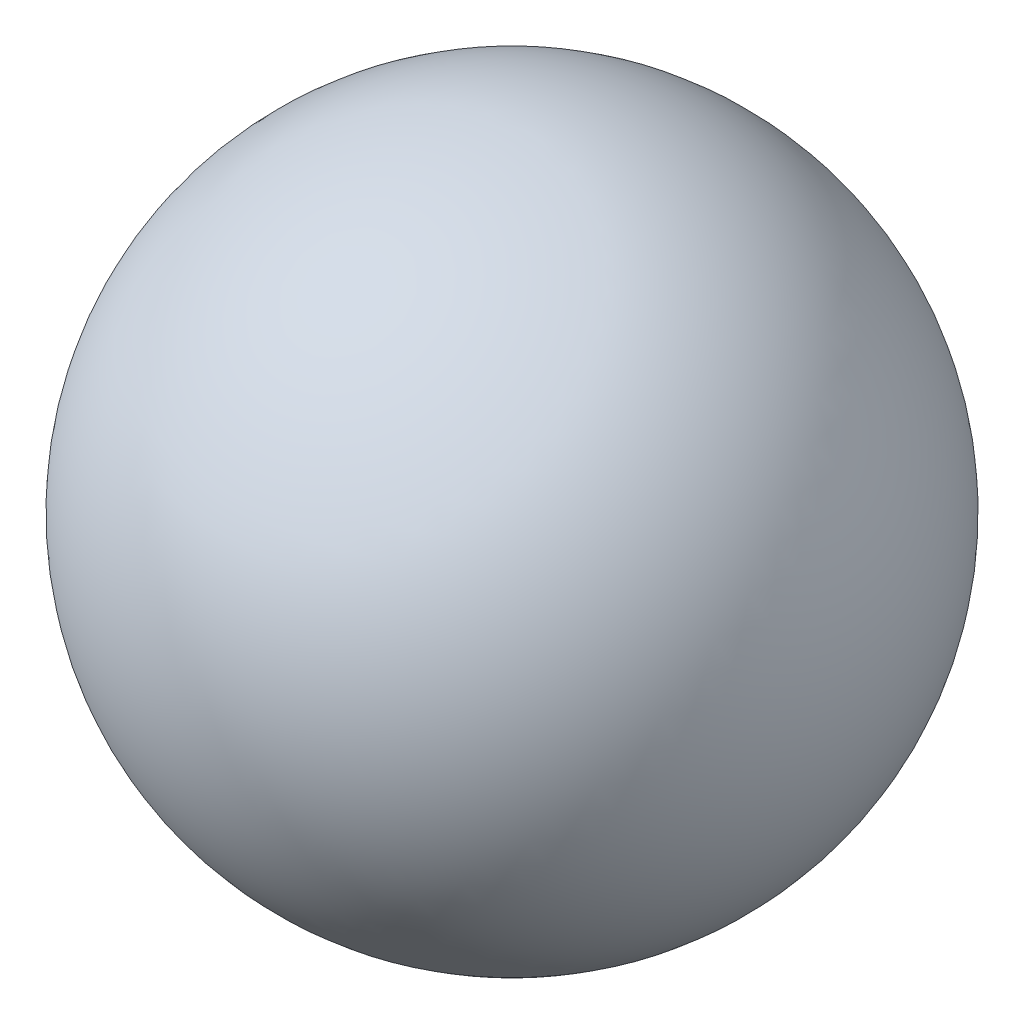
ISO-10303-21;
HEADER;
FILE_DESCRIPTION(('STEP AP214'),'2;1');
FILE_NAME('part.step','',(''),(''),'','','');
FILE_SCHEMA(('AUTOMOTIVE_DESIGN { 1 0 10303 214 1 1 1 1 }'));
ENDSEC;
DATA;
#1=APPLICATION_CONTEXT('core data for automotive mechanical design processes');
#2=APPLICATION_PROTOCOL_DEFINITION('international standard','automotive_design',2000,#1);
#3=PRODUCT_CONTEXT('',#1,'mechanical');
#4=PRODUCT('Part','Part','',(#3));
#5=PRODUCT_RELATED_PRODUCT_CATEGORY('part','',(#4));
#6=PRODUCT_DEFINITION_FORMATION('','',#4);
#7=PRODUCT_DEFINITION_CONTEXT('part definition',#1,'design');
#8=PRODUCT_DEFINITION('design','',#6,#7);
#9=PRODUCT_DEFINITION_SHAPE('','',#8);
#10=(LENGTH_UNIT() NAMED_UNIT(*) SI_UNIT(.MILLI.,.METRE.));
#11=(NAMED_UNIT(*) PLANE_ANGLE_UNIT() SI_UNIT($,.RADIAN.));
#12=(NAMED_UNIT(*) SI_UNIT($,.STERADIAN.) SOLID_ANGLE_UNIT());
#13=UNCERTAINTY_MEASURE_WITH_UNIT(LENGTH_MEASURE(1.E-05),#10,'distance_accuracy_value','');
#14=(GEOMETRIC_REPRESENTATION_CONTEXT(3) GLOBAL_UNCERTAINTY_ASSIGNED_CONTEXT((#13)) GLOBAL_UNIT_ASSIGNED_CONTEXT((#10,
#11,#12)) REPRESENTATION_CONTEXT('',''));
#15=CARTESIAN_POINT('',(0.,0.,0.));
#16=DIRECTION('',(0.,0.,1.));
#17=DIRECTION('',(1.,0.,0.));
#18=AXIS2_PLACEMENT_3D('',#15,#16,#17);
#19=CARTESIAN_POINT('',(0.,2.36880771697493,-2.36880771697494));
#20=DIRECTION('',(0.0436746395810799,0.997954029736576,0.0466934726700802));
#21=DIRECTION('',(-0.990820311528116,0.0372825196496607,0.129942771987905));
#22=AXIS2_PLACEMENT_3D('',#19,#20,#21);
#23=SPHERICAL_SURFACE('',#22,0.794);
#24=CARTESIAN_POINT('',(0.0346776638273774,3.16118321658577,-2.33173309967489));
#25=VERTEX_POINT('',#24);
#26=VERTEX_LOOP('',#25);
#27=FACE_BOUND('',#26,.T.);
#28=CARTESIAN_POINT('',(-0.0346776638273775,1.57643221736409,-2.40588233427498));
#29=VERTEX_POINT('',#28);
#30=VERTEX_LOOP('',#29);
#31=FACE_BOUND('',#30,.T.);
#32=ADVANCED_FACE('F16',(#27,#31),#23,.T.);
#33=CLOSED_SHELL('',(#32));
#34=MANIFOLD_SOLID_BREP('B1',#33);
#35=ADVANCED_BREP_SHAPE_REPRESENTATION('',(#18,#34),#14);
#36=SHAPE_DEFINITION_REPRESENTATION(#9,#35);
ENDSEC;
END-ISO-10303-21;
